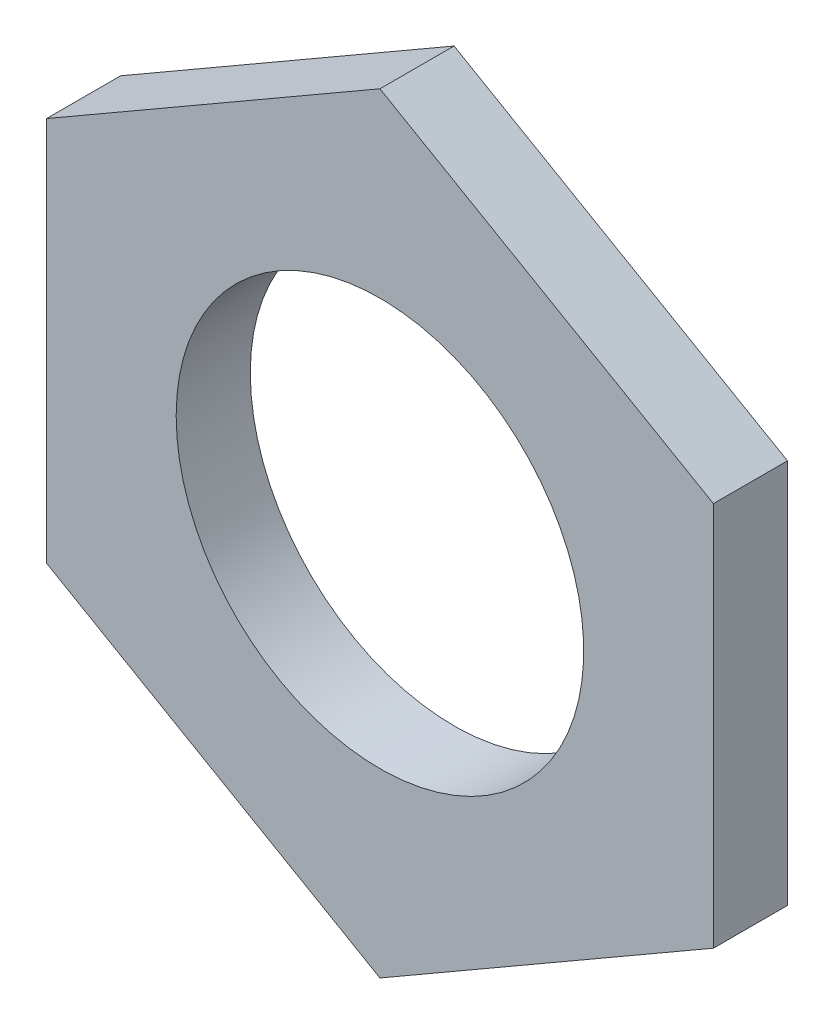
ISO-10303-21;
HEADER;
FILE_DESCRIPTION(('STEP AP214'),'2;1');
FILE_NAME('part.step','',(''),(''),'','','');
FILE_SCHEMA(('AUTOMOTIVE_DESIGN { 1 0 10303 214 1 1 1 1 }'));
ENDSEC;
DATA;
#1=APPLICATION_CONTEXT('core data for automotive mechanical design processes');
#2=APPLICATION_PROTOCOL_DEFINITION('international standard','automotive_design',2000,#1);
#3=PRODUCT_CONTEXT('',#1,'mechanical');
#4=PRODUCT('Part','Part','',(#3));
#5=PRODUCT_RELATED_PRODUCT_CATEGORY('part','',(#4));
#6=PRODUCT_DEFINITION_FORMATION('','',#4);
#7=PRODUCT_DEFINITION_CONTEXT('part definition',#1,'design');
#8=PRODUCT_DEFINITION('design','',#6,#7);
#9=PRODUCT_DEFINITION_SHAPE('','',#8);
#10=(LENGTH_UNIT() NAMED_UNIT(*) SI_UNIT(.MILLI.,.METRE.));
#11=(NAMED_UNIT(*) PLANE_ANGLE_UNIT() SI_UNIT($,.RADIAN.));
#12=(NAMED_UNIT(*) SI_UNIT($,.STERADIAN.) SOLID_ANGLE_UNIT());
#13=UNCERTAINTY_MEASURE_WITH_UNIT(LENGTH_MEASURE(1.E-05),#10,'distance_accuracy_value','');
#14=(GEOMETRIC_REPRESENTATION_CONTEXT(3) GLOBAL_UNCERTAINTY_ASSIGNED_CONTEXT((#13)) GLOBAL_UNIT_ASSIGNED_CONTEXT((#10,
#11,#12)) REPRESENTATION_CONTEXT('',''));
#15=CARTESIAN_POINT('',(0.,0.,0.));
#16=DIRECTION('',(0.,0.,1.));
#17=DIRECTION('',(1.,0.,0.));
#18=AXIS2_PLACEMENT_3D('',#15,#16,#17);
#19=CARTESIAN_POINT('',(-13.5,-7.79422863405995,3.));
#20=DIRECTION('',(0.5,0.866025403784439,0.));
#21=DIRECTION('',(-0.866025403784439,0.5,0.));
#22=AXIS2_PLACEMENT_3D('',#19,#20,#21);
#23=PLANE('',#22);
#24=DIRECTION('',(0.866025403784439,-0.5,0.));
#25=VECTOR('',#24,1.);
#26=CARTESIAN_POINT('',(-13.5,-7.79422863405995,0.));
#27=LINE('',#26,#25);
#28=CARTESIAN_POINT('',(-13.5,-7.79422863405995,0.));
#29=VERTEX_POINT('',#28);
#30=CARTESIAN_POINT('',(0.,-15.5884572681199,0.));
#31=VERTEX_POINT('',#30);
#32=EDGE_CURVE('E115',#29,#31,#27,.T.);
#33=ORIENTED_EDGE('',*,*,#32,.T.);
#34=DIRECTION('',(0.,0.,-1.));
#35=VECTOR('',#34,1.);
#36=CARTESIAN_POINT('',(0.,-15.5884572681199,3.));
#37=LINE('',#36,#35);
#38=CARTESIAN_POINT('',(0.,-15.5884572681199,3.));
#39=VERTEX_POINT('',#38);
#40=EDGE_CURVE('E11',#39,#31,#37,.T.);
#41=ORIENTED_EDGE('',*,*,#40,.F.);
#42=DIRECTION('',(0.866025403784439,-0.5,0.));
#43=VECTOR('',#42,1.);
#44=CARTESIAN_POINT('',(-13.5,-7.79422863405995,3.));
#45=LINE('',#44,#43);
#46=CARTESIAN_POINT('',(-13.5,-7.79422863405995,3.));
#47=VERTEX_POINT('',#46);
#48=EDGE_CURVE('E126',#47,#39,#45,.T.);
#49=ORIENTED_EDGE('',*,*,#48,.F.);
#50=DIRECTION('',(0.,0.,-1.));
#51=VECTOR('',#50,1.);
#52=CARTESIAN_POINT('',(-13.5,-7.79422863405995,3.));
#53=LINE('',#52,#51);
#54=EDGE_CURVE('E111',#47,#29,#53,.T.);
#55=ORIENTED_EDGE('',*,*,#54,.T.);
#56=EDGE_LOOP('',(#33,#41,#49,#55));
#57=FACE_BOUND('',#56,.T.);
#58=ADVANCED_FACE('F31',(#57),#23,.F.);
#59=CARTESIAN_POINT('',(0.,-15.5884572681199,3.));
#60=DIRECTION('',(-0.5,0.866025403784439,0.));
#61=DIRECTION('',(-0.866025403784439,-0.5,0.));
#62=AXIS2_PLACEMENT_3D('',#59,#60,#61);
#63=PLANE('',#62);
#64=DIRECTION('',(0.866025403784439,0.5,0.));
#65=VECTOR('',#64,1.);
#66=CARTESIAN_POINT('',(0.,-15.5884572681199,0.));
#67=LINE('',#66,#65);
#68=CARTESIAN_POINT('',(13.5,-7.79422863405995,0.));
#69=VERTEX_POINT('',#68);
#70=EDGE_CURVE('E118',#31,#69,#67,.T.);
#71=ORIENTED_EDGE('',*,*,#70,.T.);
#72=DIRECTION('',(0.,0.,-1.));
#73=VECTOR('',#72,1.);
#74=CARTESIAN_POINT('',(13.5,-7.79422863405995,3.));
#75=LINE('',#74,#73);
#76=CARTESIAN_POINT('',(13.5,-7.79422863405995,3.));
#77=VERTEX_POINT('',#76);
#78=EDGE_CURVE('E39',#77,#69,#75,.T.);
#79=ORIENTED_EDGE('',*,*,#78,.F.);
#80=DIRECTION('',(0.866025403784439,0.5,0.));
#81=VECTOR('',#80,1.);
#82=CARTESIAN_POINT('',(0.,-15.5884572681199,3.));
#83=LINE('',#82,#81);
#84=EDGE_CURVE('E84',#39,#77,#83,.T.);
#85=ORIENTED_EDGE('',*,*,#84,.F.);
#86=ORIENTED_EDGE('',*,*,#40,.T.);
#87=EDGE_LOOP('',(#71,#79,#85,#86));
#88=FACE_BOUND('',#87,.T.);
#89=ADVANCED_FACE('F151',(#88),#63,.F.);
#90=CARTESIAN_POINT('',(13.5,-7.79422863405995,3.));
#91=DIRECTION('',(-1.,0.,0.));
#92=DIRECTION('',(0.,-1.,0.));
#93=AXIS2_PLACEMENT_3D('',#90,#91,#92);
#94=PLANE('',#93);
#95=DIRECTION('',(0.,1.,0.));
#96=VECTOR('',#95,1.);
#97=CARTESIAN_POINT('',(13.5,-7.79422863405995,0.));
#98=LINE('',#97,#96);
#99=CARTESIAN_POINT('',(13.5,7.79422863405996,0.));
#100=VERTEX_POINT('',#99);
#101=EDGE_CURVE('E121',#69,#100,#98,.T.);
#102=ORIENTED_EDGE('',*,*,#101,.T.);
#103=DIRECTION('',(0.,0.,-1.));
#104=VECTOR('',#103,1.);
#105=CARTESIAN_POINT('',(13.5,7.79422863405996,3.));
#106=LINE('',#105,#104);
#107=CARTESIAN_POINT('',(13.5,7.79422863405996,3.));
#108=VERTEX_POINT('',#107);
#109=EDGE_CURVE('E106',#108,#100,#106,.T.);
#110=ORIENTED_EDGE('',*,*,#109,.F.);
#111=DIRECTION('',(0.,1.,0.));
#112=VECTOR('',#111,1.);
#113=CARTESIAN_POINT('',(13.5,-7.79422863405995,3.));
#114=LINE('',#113,#112);
#115=EDGE_CURVE('E97',#77,#108,#114,.T.);
#116=ORIENTED_EDGE('',*,*,#115,.F.);
#117=ORIENTED_EDGE('',*,*,#78,.T.);
#118=EDGE_LOOP('',(#102,#110,#116,#117));
#119=FACE_BOUND('',#118,.T.);
#120=ADVANCED_FACE('F132',(#119),#94,.F.);
#121=CARTESIAN_POINT('',(13.5,7.79422863405996,3.));
#122=DIRECTION('',(-0.5,-0.866025403784438,0.));
#123=DIRECTION('',(0.866025403784439,-0.5,0.));
#124=AXIS2_PLACEMENT_3D('',#121,#122,#123);
#125=PLANE('',#124);
#126=DIRECTION('',(-0.866025403784439,0.5,0.));
#127=VECTOR('',#126,1.);
#128=CARTESIAN_POINT('',(13.5,7.79422863405996,0.));
#129=LINE('',#128,#127);
#130=CARTESIAN_POINT('',(0.,15.5884572681199,0.));
#131=VERTEX_POINT('',#130);
#132=EDGE_CURVE('E105',#100,#131,#129,.T.);
#133=ORIENTED_EDGE('',*,*,#132,.T.);
#134=DIRECTION('',(0.,0.,-1.));
#135=VECTOR('',#134,1.);
#136=CARTESIAN_POINT('',(0.,15.5884572681199,3.));
#137=LINE('',#136,#135);
#138=CARTESIAN_POINT('',(0.,15.5884572681199,3.));
#139=VERTEX_POINT('',#138);
#140=EDGE_CURVE('E102',#139,#131,#137,.T.);
#141=ORIENTED_EDGE('',*,*,#140,.F.);
#142=DIRECTION('',(-0.866025403784439,0.5,0.));
#143=VECTOR('',#142,1.);
#144=CARTESIAN_POINT('',(13.5,7.79422863405996,3.));
#145=LINE('',#144,#143);
#146=EDGE_CURVE('E91',#108,#139,#145,.T.);
#147=ORIENTED_EDGE('',*,*,#146,.F.);
#148=ORIENTED_EDGE('',*,*,#109,.T.);
#149=EDGE_LOOP('',(#133,#141,#147,#148));
#150=FACE_BOUND('',#149,.T.);
#151=ADVANCED_FACE('F103',(#150),#125,.F.);
#152=CARTESIAN_POINT('',(0.,15.5884572681199,3.));
#153=DIRECTION('',(0.5,-0.866025403784438,0.));
#154=DIRECTION('',(0.866025403784439,0.5,0.));
#155=AXIS2_PLACEMENT_3D('',#152,#153,#154);
#156=PLANE('',#155);
#157=DIRECTION('',(-0.866025403784439,-0.5,0.));
#158=VECTOR('',#157,1.);
#159=CARTESIAN_POINT('',(0.,15.5884572681199,0.));
#160=LINE('',#159,#158);
#161=CARTESIAN_POINT('',(-13.5,7.79422863405994,0.));
#162=VERTEX_POINT('',#161);
#163=EDGE_CURVE('E70',#131,#162,#160,.T.);
#164=ORIENTED_EDGE('',*,*,#163,.T.);
#165=DIRECTION('',(0.,0.,-1.));
#166=VECTOR('',#165,1.);
#167=CARTESIAN_POINT('',(-13.5,7.79422863405994,3.));
#168=LINE('',#167,#166);
#169=CARTESIAN_POINT('',(-13.5,7.79422863405994,3.));
#170=VERTEX_POINT('',#169);
#171=EDGE_CURVE('E107',#170,#162,#168,.T.);
#172=ORIENTED_EDGE('',*,*,#171,.F.);
#173=DIRECTION('',(-0.866025403784439,-0.5,0.));
#174=VECTOR('',#173,1.);
#175=CARTESIAN_POINT('',(0.,15.5884572681199,3.));
#176=LINE('',#175,#174);
#177=EDGE_CURVE('E95',#139,#170,#176,.T.);
#178=ORIENTED_EDGE('',*,*,#177,.F.);
#179=ORIENTED_EDGE('',*,*,#140,.T.);
#180=EDGE_LOOP('',(#164,#172,#178,#179));
#181=FACE_BOUND('',#180,.T.);
#182=ADVANCED_FACE('F109',(#181),#156,.F.);
#183=CARTESIAN_POINT('',(-13.5,7.79422863405994,3.));
#184=DIRECTION('',(1.,0.,0.));
#185=DIRECTION('',(0.,1.,0.));
#186=AXIS2_PLACEMENT_3D('',#183,#184,#185);
#187=PLANE('',#186);
#188=DIRECTION('',(0.,-1.,0.));
#189=VECTOR('',#188,1.);
#190=CARTESIAN_POINT('',(-13.5,7.79422863405994,0.));
#191=LINE('',#190,#189);
#192=EDGE_CURVE('E76',#162,#29,#191,.T.);
#193=ORIENTED_EDGE('',*,*,#192,.T.);
#194=ORIENTED_EDGE('',*,*,#54,.F.);
#195=DIRECTION('',(0.,-1.,0.));
#196=VECTOR('',#195,1.);
#197=CARTESIAN_POINT('',(-13.5,7.79422863405994,3.));
#198=LINE('',#197,#196);
#199=EDGE_CURVE('E47',#170,#47,#198,.T.);
#200=ORIENTED_EDGE('',*,*,#199,.F.);
#201=ORIENTED_EDGE('',*,*,#171,.T.);
#202=EDGE_LOOP('',(#193,#194,#200,#201));
#203=FACE_BOUND('',#202,.T.);
#204=ADVANCED_FACE('F139',(#203),#187,.F.);
#205=CARTESIAN_POINT('',(0.,-15.5884572681199,3.));
#206=DIRECTION('',(0.,0.,1.));
#207=DIRECTION('',(1.,0.,0.));
#208=AXIS2_PLACEMENT_3D('',#205,#206,#207);
#209=PLANE('',#208);
#210=CARTESIAN_POINT('',(0.,0.,3.));
#211=DIRECTION('',(0.,0.,-1.));
#212=DIRECTION('',(-1.,0.,0.));
#213=AXIS2_PLACEMENT_3D('',#210,#211,#212);
#214=CIRCLE('',#213,8.25);
#215=CARTESIAN_POINT('',(-8.25,0.,3.));
#216=VERTEX_POINT('',#215);
#217=EDGE_CURVE('E119',#216,#216,#214,.T.);
#218=ORIENTED_EDGE('',*,*,#217,.T.);
#219=EDGE_LOOP('',(#218));
#220=FACE_BOUND('',#219,.T.);
#221=ORIENTED_EDGE('',*,*,#48,.T.);
#222=ORIENTED_EDGE('',*,*,#84,.T.);
#223=ORIENTED_EDGE('',*,*,#115,.T.);
#224=ORIENTED_EDGE('',*,*,#146,.T.);
#225=ORIENTED_EDGE('',*,*,#177,.T.);
#226=ORIENTED_EDGE('',*,*,#199,.T.);
#227=EDGE_LOOP('',(#221,#222,#223,#224,#225,#226));
#228=FACE_BOUND('',#227,.T.);
#229=ADVANCED_FACE('F93',(#220,#228),#209,.T.);
#230=CARTESIAN_POINT('',(0.,-15.5884572681199,0.));
#231=DIRECTION('',(0.,0.,1.));
#232=DIRECTION('',(1.,0.,0.));
#233=AXIS2_PLACEMENT_3D('',#230,#231,#232);
#234=PLANE('',#233);
#235=CARTESIAN_POINT('',(0.,0.,0.));
#236=DIRECTION('',(0.,0.,-1.));
#237=DIRECTION('',(-1.,0.,0.));
#238=AXIS2_PLACEMENT_3D('',#235,#236,#237);
#239=CIRCLE('',#238,8.24999999999999);
#240=CARTESIAN_POINT('',(-8.24999999999999,0.,0.));
#241=VERTEX_POINT('',#240);
#242=EDGE_CURVE('E206',#241,#241,#239,.T.);
#243=ORIENTED_EDGE('',*,*,#242,.F.);
#244=EDGE_LOOP('',(#243));
#245=FACE_BOUND('',#244,.T.);
#246=ORIENTED_EDGE('',*,*,#32,.F.);
#247=ORIENTED_EDGE('',*,*,#192,.F.);
#248=ORIENTED_EDGE('',*,*,#163,.F.);
#249=ORIENTED_EDGE('',*,*,#132,.F.);
#250=ORIENTED_EDGE('',*,*,#101,.F.);
#251=ORIENTED_EDGE('',*,*,#70,.F.);
#252=EDGE_LOOP('',(#246,#247,#248,#249,#250,#251));
#253=FACE_BOUND('',#252,.T.);
#254=ADVANCED_FACE('F135',(#245,#253),#234,.F.);
#255=CARTESIAN_POINT('',(0.,0.,0.));
#256=DIRECTION('',(0.,0.,-1.));
#257=DIRECTION('',(-1.,0.,0.));
#258=AXIS2_PLACEMENT_3D('',#255,#256,#257);
#259=CYLINDRICAL_SURFACE('',#258,8.24999999999999);
#260=ORIENTED_EDGE('',*,*,#217,.F.);
#261=EDGE_LOOP('',(#260));
#262=FACE_BOUND('',#261,.T.);
#263=ORIENTED_EDGE('',*,*,#242,.T.);
#264=EDGE_LOOP('',(#263));
#265=FACE_BOUND('',#264,.T.);
#266=ADVANCED_FACE('F188',(#262,#265),#259,.F.);
#267=CLOSED_SHELL('',(#58,#89,#120,#151,#182,#204,#229,#254,#266));
#268=MANIFOLD_SOLID_BREP('B2',#267);
#269=ADVANCED_BREP_SHAPE_REPRESENTATION('',(#18,#268),#14);
#270=SHAPE_DEFINITION_REPRESENTATION(#9,#269);
ENDSEC;
END-ISO-10303-21;
